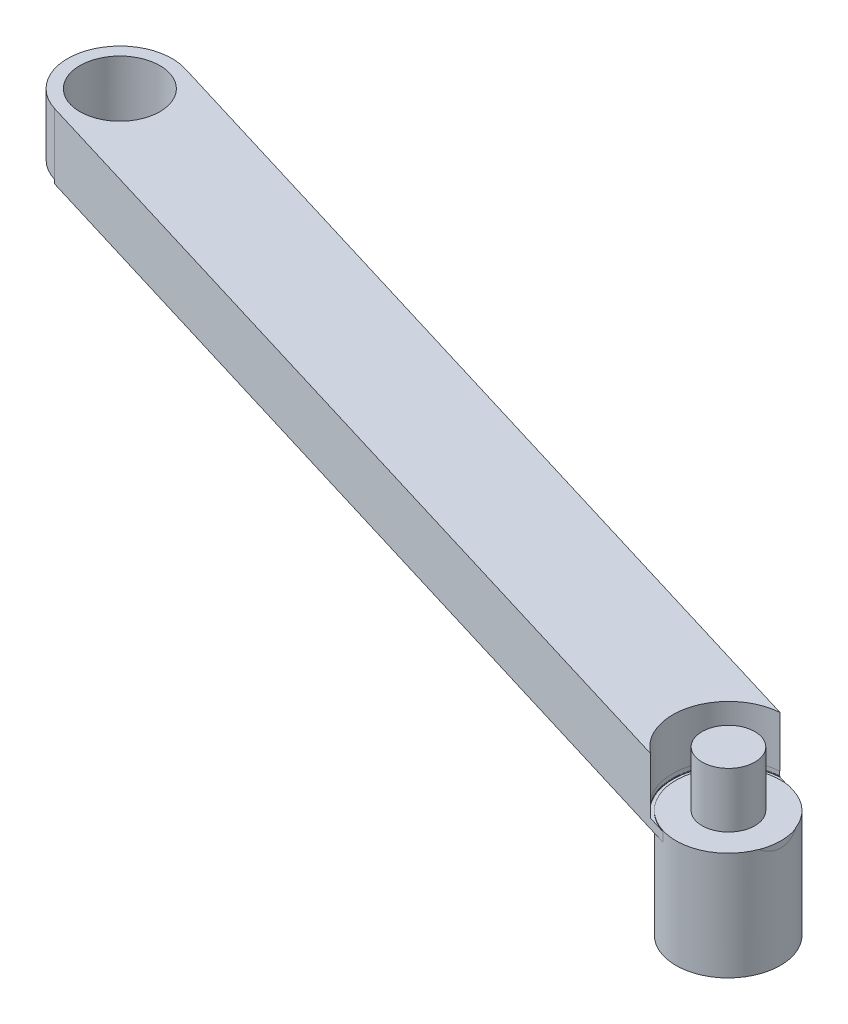
ISO-10303-21;
HEADER;
FILE_DESCRIPTION(('STEP AP214'),'2;1');
FILE_NAME('part.step','',(''),(''),'','','');
FILE_SCHEMA(('AUTOMOTIVE_DESIGN { 1 0 10303 214 1 1 1 1 }'));
ENDSEC;
DATA;
#1=APPLICATION_CONTEXT('core data for automotive mechanical design processes');
#2=APPLICATION_PROTOCOL_DEFINITION('international standard','automotive_design',2000,#1);
#3=PRODUCT_CONTEXT('',#1,'mechanical');
#4=PRODUCT('Part','Part','',(#3));
#5=PRODUCT_RELATED_PRODUCT_CATEGORY('part','',(#4));
#6=PRODUCT_DEFINITION_FORMATION('','',#4);
#7=PRODUCT_DEFINITION_CONTEXT('part definition',#1,'design');
#8=PRODUCT_DEFINITION('design','',#6,#7);
#9=PRODUCT_DEFINITION_SHAPE('','',#8);
#10=(LENGTH_UNIT() NAMED_UNIT(*) SI_UNIT(.MILLI.,.METRE.));
#11=(NAMED_UNIT(*) PLANE_ANGLE_UNIT() SI_UNIT($,.RADIAN.));
#12=(NAMED_UNIT(*) SI_UNIT($,.STERADIAN.) SOLID_ANGLE_UNIT());
#13=UNCERTAINTY_MEASURE_WITH_UNIT(LENGTH_MEASURE(1.E-05),#10,'distance_accuracy_value','');
#14=(GEOMETRIC_REPRESENTATION_CONTEXT(3) GLOBAL_UNCERTAINTY_ASSIGNED_CONTEXT((#13)) GLOBAL_UNIT_ASSIGNED_CONTEXT((#10,
#11,#12)) REPRESENTATION_CONTEXT('',''));
#15=CARTESIAN_POINT('',(0.,0.,0.));
#16=DIRECTION('',(0.,0.,1.));
#17=DIRECTION('',(1.,0.,0.));
#18=AXIS2_PLACEMENT_3D('',#15,#16,#17);
#19=CARTESIAN_POINT('',(-25.9995446629115,44.1741982646806,27.5355118521963));
#20=DIRECTION('',(0.,1.,0.));
#21=DIRECTION('',(0.956704163119757,0.,0.291062096930065));
#22=AXIS2_PLACEMENT_3D('',#19,#20,#21);
#23=PLANE('',#22);
#24=CARTESIAN_POINT('',(64.8873508334654,44.1741982646806,55.1864110605525));
#25=DIRECTION('',(0.,1.,0.));
#26=DIRECTION('',(0.956704163119757,0.,0.291062096930065));
#27=AXIS2_PLACEMENT_3D('',#24,#25,#26);
#28=CIRCLE('',#27,4.);
#29=CARTESIAN_POINT('',(68.7141674859444,44.1741982646806,56.3506594482727));
#30=VERTEX_POINT('',#29);
#31=EDGE_CURVE('E261',#30,#30,#28,.T.);
#32=ORIENTED_EDGE('',*,*,#31,.F.);
#33=EDGE_LOOP('',(#32));
#34=FACE_BOUND('',#33,.T.);
#35=ADVANCED_FACE('F45',(#34),#23,.F.);
#36=CARTESIAN_POINT('',(64.8930357480705,57.4541363944663,55.1677250772969));
#37=DIRECTION('',(0.,-1.,0.));
#38=DIRECTION('',(0.0291383118816099,0.,-0.999575389243198));
#39=AXIS2_PLACEMENT_3D('',#36,#37,#38);
#40=CYLINDRICAL_SURFACE('',#39,4.01953162113846);
#41=CARTESIAN_POINT('',(68.5120653892874,52.7701991631346,56.9167988062531));
#42=CARTESIAN_POINT('',(68.5320828336412,52.7221278434934,56.8753807158891));
#43=CARTESIAN_POINT('',(68.5521676642916,52.6758096040252,56.8320058476421));
#44=CARTESIAN_POINT('',(68.5920181084612,52.5868622370855,56.7414517357876));
#45=CARTESIAN_POINT('',(68.611783581888,52.5442346946901,56.6942708742261));
#46=CARTESIAN_POINT('',(68.6700687594579,52.4218539904196,56.5467950762777));
#47=CARTESIAN_POINT('',(68.7073874409589,52.3480421194024,56.4409443446482));
#48=CARTESIAN_POINT('',(68.7751938496416,52.2184792637633,56.2162023758633));
#49=CARTESIAN_POINT('',(68.8056586191773,52.1627887077172,56.0972692418918));
#50=CARTESIAN_POINT('',(68.8562596580061,52.07237341335,55.84988055207));
#51=CARTESIAN_POINT('',(68.8764244897262,52.0375906483578,55.721452472571));
#52=CARTESIAN_POINT('',(68.9029057457369,51.9928439154912,55.4710216541739));
#53=CARTESIAN_POINT('',(68.9103056600404,51.9809271454764,55.3494816676416));
#54=CARTESIAN_POINT('',(68.9139353757365,51.9764334949345,55.1058361634686));
#55=CARTESIAN_POINT('',(68.9101631973892,51.9838600420934,54.9837305494246));
#56=CARTESIAN_POINT('',(68.8925403772751,52.0163027651151,54.7515397966203));
#57=CARTESIAN_POINT('',(68.8794199277257,52.0400403586657,54.6412145572608));
#58=CARTESIAN_POINT('',(68.8450881149345,52.1025862904002,54.4262596456784));
#59=CARTESIAN_POINT('',(68.823874605951,52.1413986254535,54.3216314923585));
#60=CARTESIAN_POINT('',(68.773562736474,52.2353934426095,54.1140444106715));
#61=CARTESIAN_POINT('',(68.7440645748894,52.2914251653039,54.0115705529702));
#62=CARTESIAN_POINT('',(68.6802234974584,52.4170746399695,53.8170518553445));
#63=CARTESIAN_POINT('',(68.6458821525841,52.4866879892961,53.7250036510636));
#64=CARTESIAN_POINT('',(68.5951968647744,52.5948214358765,53.6017586947762));
#65=CARTESIAN_POINT('',(68.5797511969987,52.6284489267673,53.5657815995579));
#66=CARTESIAN_POINT('',(68.5486962072247,52.6977759093592,53.4961301248221));
#67=CARTESIAN_POINT('',(68.5330873193654,52.7334706862006,53.4624508595444));
#68=CARTESIAN_POINT('',(68.5174841742204,52.7701991631346,53.4299080387363));
#69=B_SPLINE_CURVE_WITH_KNOTS('',3,(#41,#42,#43,#44,#45,#46,#47,#48,#49,#50,#51,#52,#53,#54,#55,
#56,#57,#58,#59,#60,#61,#62,#63,#64,#65,#66,#67,#68),.UNSPECIFIED.,.F.,.F.,(4,2,2,2,2,2,2,2,2,2,
2,2,2,4),(0.,0.19949647436116,0.399078207551685,0.800049133333823,1.20234377852681,
1.60351669281897,1.96856565127002,2.33367930174427,2.67302106211815,3.01245285597977,
3.37244672636312,3.73232409379485,3.88708342006847,4.04150271496431),.UNSPECIFIED.);
#70=CARTESIAN_POINT('',(68.6570358919749,52.4498767005648,56.5780219857596));
#71=VERTEX_POINT('',#70);
#72=CARTESIAN_POINT('',(68.6643823357625,52.4498767005648,53.7771930320583));
#73=VERTEX_POINT('',#72);
#74=EDGE_CURVE('E158',#71,#73,#69,.T.);
#75=ORIENTED_EDGE('',*,*,#74,.T.);
#76=CARTESIAN_POINT('',(64.8930357480705,52.4498767005648,55.1677250772969));
#77=DIRECTION('',(0.,1.,0.));
#78=DIRECTION('',(-0.0291383118816099,0.,0.999575389243198));
#79=AXIS2_PLACEMENT_3D('',#76,#77,#78);
#80=CIRCLE('',#79,4.01953162113846);
#81=EDGE_CURVE('E325',#71,#73,#80,.T.);
#82=ORIENTED_EDGE('',*,*,#81,.F.);
#83=EDGE_LOOP('',(#75,#82));
#84=FACE_BOUND('',#83,.T.);
#85=ADVANCED_FACE('F370',(#84),#40,.T.);
#86=CARTESIAN_POINT('',(116.984664831287,54.2919383485026,56.5862841412071));
#87=DIRECTION('',(-0.999575389243198,0.,-0.0291383118816099));
#88=DIRECTION('',(-0.0291383118816099,0.,0.999575389243198));
#89=AXIS2_PLACEMENT_3D('',#86,#87,#88);
#90=CYLINDRICAL_SURFACE('',#89,2.31365217276674);
#91=CARTESIAN_POINT('',(68.6305208180353,52.4498767005648,53.7762059454664));
#92=CARTESIAN_POINT('',(68.6487620826173,52.4135070230867,53.8246229769609));
#93=CARTESIAN_POINT('',(68.6664943209228,52.3789158246489,53.8745430482517));
#94=CARTESIAN_POINT('',(68.700605440598,52.3134859277549,53.9772691205152));
#95=CARTESIAN_POINT('',(68.7169834595987,52.2826496145984,54.0300769253841));
#96=CARTESIAN_POINT('',(68.7636601095959,52.1959253819904,54.1929456338648));
#97=CARTESIAN_POINT('',(68.7913652057291,52.1460867858058,54.3071017497967));
#98=CARTESIAN_POINT('',(68.8372970872995,52.064594532309,54.5441084924797));
#99=CARTESIAN_POINT('',(68.8554842032362,52.033016927575,54.6669931215435));
#100=CARTESIAN_POINT('',(68.8802462723031,51.9902526228353,54.9171461443951));
#101=CARTESIAN_POINT('',(68.8868523365755,51.979011289208,55.044401854009));
#102=CARTESIAN_POINT('',(68.8877555125507,51.977686918945,55.2882749414438));
#103=CARTESIAN_POINT('',(68.883044951865,51.9858973216265,55.4048832125624));
#104=CARTESIAN_POINT('',(68.8638125198351,52.0197015861573,55.6348210793775));
#105=CARTESIAN_POINT('',(68.8492812408215,52.0453121164282,55.7481474225262));
#106=CARTESIAN_POINT('',(68.8121848808176,52.1120710291255,55.9659245012462));
#107=CARTESIAN_POINT('',(68.789799577773,52.1528728671973,56.0705138315507));
#108=CARTESIAN_POINT('',(68.7388281841445,52.2485447843305,56.2712242746911));
#109=CARTESIAN_POINT('',(68.7102497777448,52.3033974448446,56.3673556758452));
#110=CARTESIAN_POINT('',(68.6660407959979,52.3917389999655,56.499182127393));
#111=CARTESIAN_POINT('',(68.652011120781,52.4202223061095,56.5388476876161));
#112=CARTESIAN_POINT('',(68.6376826716132,52.4498767005648,56.5774578260405));
#113=B_SPLINE_CURVE_WITH_KNOTS('',3,(#91,#92,#93,#94,#95,#96,#97,#98,#99,#100,#101,#102,#103,
#104,#105,#106,#107,#108,#109,#110,#111,#112),.UNSPECIFIED.,.F.,.F.,(4,2,2,2,2,2,2,2,2,2,4),(0.,
0.189639969590812,0.379399786803515,0.760282346211737,1.14273997183633,1.52416858621479,
1.87338726773213,2.22294095523211,2.56496575076364,2.90656857926699,3.05887183267353),.UNSPECIFIED.);
#114=CARTESIAN_POINT('',(68.6305208180353,52.4498767005648,53.7762059454664));
#115=VERTEX_POINT('',#114);
#116=CARTESIAN_POINT('',(68.6376826716132,52.4498767005648,56.5774578260405));
#117=VERTEX_POINT('',#116);
#118=EDGE_CURVE('E156',#115,#117,#113,.T.);
#119=ORIENTED_EDGE('',*,*,#118,.F.);
#120=DIRECTION('',(-0.999575389243198,0.,-0.0291383118816099));
#121=VECTOR('',#120,1.);
#122=CARTESIAN_POINT('',(117.025456337248,52.4498767005648,55.186951687933));
#123=LINE('',#122,#121);
#124=EDGE_CURVE('E164',#73,#115,#123,.T.);
#125=ORIENTED_EDGE('',*,*,#124,.F.);
#126=ORIENTED_EDGE('',*,*,#74,.F.);
#127=DIRECTION('',(-0.999575389243198,0.,-0.0291383118816099));
#128=VECTOR('',#127,1.);
#129=CARTESIAN_POINT('',(116.943873325325,52.4498767005648,57.9856165944812));
#130=LINE('',#129,#128);
#131=EDGE_CURVE('E152',#117,#71,#130,.F.);
#132=ORIENTED_EDGE('',*,*,#131,.F.);
#133=EDGE_LOOP('',(#119,#125,#126,#132));
#134=FACE_BOUND('',#133,.T.);
#135=ADVANCED_FACE('F154',(#134),#90,.T.);
#136=CARTESIAN_POINT('',(-2.08194058491754,56.8890920513354,34.8120642754479));
#137=DIRECTION('',(0.,1.,0.));
#138=DIRECTION('',(-0.0291383118816099,0.,0.999575389243198));
#139=AXIS2_PLACEMENT_3D('',#136,#137,#138);
#140=CYLINDRICAL_SURFACE('',#139,3.06284499681519);
#141=CARTESIAN_POINT('',(-2.08194058491754,56.6741982646806,34.8120642754479));
#142=DIRECTION('',(0.,1.,0.));
#143=DIRECTION('',(-0.999575389243198,0.,-0.0291383118816099));
#144=AXIS2_PLACEMENT_3D('',#141,#142,#143);
#145=CIRCLE('',#144,3.06284499681519);
#146=CARTESIAN_POINT('',(-5.14348506480066,56.6741982646806,34.7228181426857));
#147=VERTEX_POINT('',#146);
#148=EDGE_CURVE('E212',#147,#147,#145,.T.);
#149=ORIENTED_EDGE('',*,*,#148,.T.);
#150=EDGE_LOOP('',(#149));
#151=FACE_BOUND('',#150,.T.);
#152=CARTESIAN_POINT('',(-2.08194058491754,51.9649659412139,34.8120642754479));
#153=DIRECTION('',(0.,1.,0.));
#154=DIRECTION('',(-0.0291383118816099,0.,0.999575389243198));
#155=AXIS2_PLACEMENT_3D('',#152,#153,#154);
#156=CIRCLE('',#155,3.06284499681519);
#157=CARTESIAN_POINT('',(-2.17118671767977,51.9649659412139,37.873608755331));
#158=VERTEX_POINT('',#157);
#159=EDGE_CURVE('E55',#158,#158,#156,.T.);
#160=ORIENTED_EDGE('',*,*,#159,.F.);
#161=EDGE_LOOP('',(#160));
#162=FACE_BOUND('',#161,.T.);
#163=ADVANCED_FACE('F394',(#151,#162),#140,.F.);
#164=CARTESIAN_POINT('',(67.0183938599423,52.383512831824,51.7560557865196));
#165=DIRECTION('',(0.,1.,0.));
#166=DIRECTION('',(-0.0291383118816099,0.,0.999575389243198));
#167=AXIS2_PLACEMENT_3D('',#164,#165,#166);
#168=PLANE('',#167);
#169=DIRECTION('',(0.956704163119757,0.,0.291062096930065));
#170=VECTOR('',#169,1.);
#171=CARTESIAN_POINT('',(-27.1637930506317,52.383512831824,31.3623285046753));
#172=LINE('',#171,#170);
#173=CARTESIAN_POINT('',(62.3548577685909,52.383512831824,58.5969609294239));
#174=VERTEX_POINT('',#173);
#175=CARTESIAN_POINT('',(63.7231024457452,52.383512831824,59.0132277130315));
#176=VERTEX_POINT('',#175);
#177=EDGE_CURVE('E236',#174,#176,#172,.T.);
#178=ORIENTED_EDGE('',*,*,#177,.T.);
#179=CARTESIAN_POINT('',(64.8930357480705,52.383512831824,55.1677250772969));
#180=DIRECTION('',(0.,1.,0.));
#181=DIRECTION('',(-0.0291383118816099,0.,0.999575389243198));
#182=AXIS2_PLACEMENT_3D('',#179,#180,#181);
#183=CIRCLE('',#182,4.01953162113844);
#184=CARTESIAN_POINT('',(65.5167802540928,52.383512831824,51.19688420356));
#185=VERTEX_POINT('',#184);
#186=EDGE_CURVE('E292',#185,#176,#183,.T.);
#187=ORIENTED_EDGE('',*,*,#186,.F.);
#188=DIRECTION('',(0.956704163119757,0.,0.291062096930065));
#189=VECTOR('',#188,1.);
#190=CARTESIAN_POINT('',(-24.8352962751912,52.383512831824,23.7086951997173));
#191=LINE('',#190,#189);
#192=CARTESIAN_POINT('',(64.5825434618207,52.383512831824,50.9126574485502));
#193=VERTEX_POINT('',#192);
#194=EDGE_CURVE('E249',#193,#185,#191,.T.);
#195=ORIENTED_EDGE('',*,*,#194,.F.);
#196=CARTESIAN_POINT('',(64.8930357480705,52.383512831824,55.1677250772969));
#197=DIRECTION('',(0.,1.,0.));
#198=DIRECTION('',(-0.0291383118816099,0.,0.999575389243198));
#199=AXIS2_PLACEMENT_3D('',#196,#197,#198);
#200=CIRCLE('',#199,4.26638090013398);
#201=EDGE_CURVE('E296',#193,#174,#200,.T.);
#202=ORIENTED_EDGE('',*,*,#201,.T.);
#203=EDGE_LOOP('',(#178,#187,#195,#202));
#204=FACE_BOUND('',#203,.T.);
#205=ADVANCED_FACE('F391',(#204),#168,.T.);
#206=CARTESIAN_POINT('',(64.8930357480705,57.4541363944663,55.1677250772969));
#207=DIRECTION('',(0.,1.,0.));
#208=DIRECTION('',(-0.0291383118816099,0.,0.999575389243198));
#209=AXIS2_PLACEMENT_3D('',#206,#207,#208);
#210=CYLINDRICAL_SURFACE('',#209,4.26638090013398);
#211=DIRECTION('',(0.,1.,0.));
#212=VECTOR('',#211,1.);
#213=CARTESIAN_POINT('',(64.5825434618207,57.4541363944663,50.9126574485502));
#214=LINE('',#213,#212);
#215=CARTESIAN_POINT('',(64.5825434618207,52.4498767005648,50.9126574485502));
#216=VERTEX_POINT('',#215);
#217=EDGE_CURVE('E291',#216,#193,#214,.F.);
#218=ORIENTED_EDGE('',*,*,#217,.F.);
#219=CARTESIAN_POINT('',(64.8930357480705,52.4498767005648,55.1677250772969));
#220=DIRECTION('',(0.,1.,0.));
#221=DIRECTION('',(-0.0291383118816099,0.,0.999575389243198));
#222=AXIS2_PLACEMENT_3D('',#219,#220,#221);
#223=CIRCLE('',#222,4.26638090013398);
#224=CARTESIAN_POINT('',(62.3548577685909,52.4498767005648,58.5969609294239));
#225=VERTEX_POINT('',#224);
#226=EDGE_CURVE('E182',#216,#225,#223,.T.);
#227=ORIENTED_EDGE('',*,*,#226,.T.);
#228=DIRECTION('',(0.,1.,0.));
#229=VECTOR('',#228,1.);
#230=CARTESIAN_POINT('',(62.3548577685909,57.4541363944663,58.5969609294239));
#231=LINE('',#230,#229);
#232=EDGE_CURVE('E286',#225,#174,#231,.F.);
#233=ORIENTED_EDGE('',*,*,#232,.T.);
#234=ORIENTED_EDGE('',*,*,#201,.F.);
#235=EDGE_LOOP('',(#218,#227,#233,#234));
#236=FACE_BOUND('',#235,.T.);
#237=ADVANCED_FACE('F319',(#236),#210,.F.);
#238=CARTESIAN_POINT('',(72.9688137710667,52.4498767005648,28.6231129944398));
#239=DIRECTION('',(0.,1.,0.));
#240=DIRECTION('',(-0.0291383118816099,0.,0.999575389243198));
#241=AXIS2_PLACEMENT_3D('',#238,#239,#240);
#242=PLANE('',#241);
#243=DIRECTION('',(0.956704163119757,0.,0.291062096930065));
#244=VECTOR('',#243,1.);
#245=CARTESIAN_POINT('',(-27.1637930506317,52.4498767005648,31.3623285046753));
#246=LINE('',#245,#244);
#247=CARTESIAN_POINT('',(62.3217790604608,52.4498767005648,58.5868972561137));
#248=VERTEX_POINT('',#247);
#249=EDGE_CURVE('E302',#248,#225,#246,.T.);
#250=ORIENTED_EDGE('',*,*,#249,.T.);
#251=ORIENTED_EDGE('',*,*,#226,.F.);
#252=DIRECTION('',(0.956704163119757,0.,0.291062096930065));
#253=VECTOR('',#252,1.);
#254=CARTESIAN_POINT('',(-24.8352962751912,52.4498767005648,23.7086951997173));
#255=LINE('',#254,#253);
#256=CARTESIAN_POINT('',(64.5516863711483,52.4498767005648,50.9032696671832));
#257=VERTEX_POINT('',#256);
#258=EDGE_CURVE('E190',#257,#216,#255,.T.);
#259=ORIENTED_EDGE('',*,*,#258,.F.);
#260=CARTESIAN_POINT('',(64.8930357480705,52.4498767005648,55.1677250772969));
#261=DIRECTION('',(0.,1.,0.));
#262=DIRECTION('',(-0.0291383118816099,0.,0.999575389243198));
#263=AXIS2_PLACEMENT_3D('',#260,#261,#262);
#264=CIRCLE('',#263,4.27809529369937);
#265=EDGE_CURVE('E204',#257,#248,#264,.T.);
#266=ORIENTED_EDGE('',*,*,#265,.T.);
#267=EDGE_LOOP('',(#250,#251,#259,#266));
#268=FACE_BOUND('',#267,.T.);
#269=ADVANCED_FACE('F401',(#268),#242,.T.);
#270=CARTESIAN_POINT('',(64.8930357480705,57.4541363944663,55.1677250772969));
#271=DIRECTION('',(0.,1.,0.));
#272=DIRECTION('',(-0.0291383118816099,0.,0.999575389243198));
#273=AXIS2_PLACEMENT_3D('',#270,#271,#272);
#274=CYLINDRICAL_SURFACE('',#273,4.27809529369937);
#275=DIRECTION('',(0.,1.,0.));
#276=VECTOR('',#275,1.);
#277=CARTESIAN_POINT('',(62.3217790604608,57.4541363944663,58.5868972561137));
#278=LINE('',#277,#276);
#279=CARTESIAN_POINT('',(62.3217790604608,52.7701991631346,58.5868972561137));
#280=VERTEX_POINT('',#279);
#281=EDGE_CURVE('E300',#280,#248,#278,.F.);
#282=ORIENTED_EDGE('',*,*,#281,.T.);
#283=ORIENTED_EDGE('',*,*,#265,.F.);
#284=DIRECTION('',(0.,1.,0.));
#285=VECTOR('',#284,1.);
#286=CARTESIAN_POINT('',(64.5516863711483,57.4541363944663,50.9032696671832));
#287=LINE('',#286,#285);
#288=CARTESIAN_POINT('',(64.5516863711483,52.7701991631346,50.9032696671832));
#289=VERTEX_POINT('',#288);
#290=EDGE_CURVE('E315',#289,#257,#287,.F.);
#291=ORIENTED_EDGE('',*,*,#290,.F.);
#292=CARTESIAN_POINT('',(64.8930357480705,52.7701991631346,55.1677250772969));
#293=DIRECTION('',(0.,1.,0.));
#294=DIRECTION('',(-0.0291383118816099,0.,0.999575389243198));
#295=AXIS2_PLACEMENT_3D('',#292,#293,#294);
#296=CIRCLE('',#295,4.27809529369937);
#297=EDGE_CURVE('E208',#289,#280,#296,.T.);
#298=ORIENTED_EDGE('',*,*,#297,.T.);
#299=EDGE_LOOP('',(#282,#283,#291,#298));
#300=FACE_BOUND('',#299,.T.);
#301=ADVANCED_FACE('F398',(#300),#274,.F.);
#302=CARTESIAN_POINT('',(72.9688137710667,52.7701991631346,28.6231129944398));
#303=DIRECTION('',(0.,1.,0.));
#304=DIRECTION('',(-0.0291383118816099,0.,0.999575389243198));
#305=AXIS2_PLACEMENT_3D('',#302,#303,#304);
#306=PLANE('',#305);
#307=ORIENTED_EDGE('',*,*,#297,.F.);
#308=DIRECTION('',(0.956704163119757,0.,0.291062096930065));
#309=VECTOR('',#308,1.);
#310=CARTESIAN_POINT('',(-24.8352962751912,52.7701991631346,23.7086951997173));
#311=LINE('',#310,#309);
#312=CARTESIAN_POINT('',(64.5825434618207,52.7701991631346,50.9126574485502));
#313=VERTEX_POINT('',#312);
#314=EDGE_CURVE('E200',#289,#313,#311,.T.);
#315=ORIENTED_EDGE('',*,*,#314,.T.);
#316=CARTESIAN_POINT('',(64.8930357480705,52.7701991631346,55.1677250772969));
#317=DIRECTION('',(0.,1.,0.));
#318=DIRECTION('',(-0.0291383118816099,0.,0.999575389243198));
#319=AXIS2_PLACEMENT_3D('',#316,#317,#318);
#320=CIRCLE('',#319,4.26638090013398);
#321=CARTESIAN_POINT('',(62.3548577685909,52.7701991631346,58.5969609294239));
#322=VERTEX_POINT('',#321);
#323=EDGE_CURVE('E201',#313,#322,#320,.T.);
#324=ORIENTED_EDGE('',*,*,#323,.T.);
#325=DIRECTION('',(0.956704163119757,0.,0.291062096930065));
#326=VECTOR('',#325,1.);
#327=CARTESIAN_POINT('',(-27.1637930506317,52.7701991631346,31.3623285046753));
#328=LINE('',#327,#326);
#329=EDGE_CURVE('E196',#280,#322,#328,.T.);
#330=ORIENTED_EDGE('',*,*,#329,.F.);
#331=EDGE_LOOP('',(#307,#315,#324,#330));
#332=FACE_BOUND('',#331,.T.);
#333=ADVANCED_FACE('F47',(#332),#306,.F.);
#334=ORIENTED_EDGE('',*,*,#323,.F.);
#335=CARTESIAN_POINT('',(64.5825434618207,56.6741982646806,50.9126574485502));
#336=VERTEX_POINT('',#335);
#337=EDGE_CURVE('E287',#336,#313,#214,.F.);
#338=ORIENTED_EDGE('',*,*,#337,.F.);
#339=CARTESIAN_POINT('',(64.8930357480705,56.6741982646806,55.1677250772969));
#340=DIRECTION('',(0.,1.,0.));
#341=DIRECTION('',(-0.999575389243198,0.,-0.0291383118816099));
#342=AXIS2_PLACEMENT_3D('',#339,#340,#341);
#343=CIRCLE('',#342,4.26638090013398);
#344=CARTESIAN_POINT('',(62.3548577685909,56.6741982646806,58.5969609294239));
#345=VERTEX_POINT('',#344);
#346=EDGE_CURVE('E253',#345,#336,#343,.F.);
#347=ORIENTED_EDGE('',*,*,#346,.F.);
#348=EDGE_CURVE('E235',#345,#322,#231,.F.);
#349=ORIENTED_EDGE('',*,*,#348,.T.);
#350=EDGE_LOOP('',(#334,#338,#347,#349));
#351=FACE_BOUND('',#350,.T.);
#352=ADVANCED_FACE('F354',(#351),#210,.F.);
#353=CARTESIAN_POINT('',(-25.9995446629115,56.6741982646806,27.5355118521963));
#354=DIRECTION('',(0.,1.,0.));
#355=DIRECTION('',(0.956704163119757,0.,0.291062096930065));
#356=AXIS2_PLACEMENT_3D('',#353,#354,#355);
#357=PLANE('',#356);
#358=ORIENTED_EDGE('',*,*,#148,.F.);
#359=EDGE_LOOP('',(#358));
#360=FACE_BOUND('',#359,.T.);
#361=DIRECTION('',(0.956704163119757,0.,0.291062096930065));
#362=VECTOR('',#361,1.);
#363=CARTESIAN_POINT('',(-27.1637930506317,56.6741982646806,31.3623285046753));
#364=LINE('',#363,#362);
#365=CARTESIAN_POINT('',(-3.24618897263783,56.6741982646806,38.6388809279269));
#366=VERTEX_POINT('',#365);
#367=EDGE_CURVE('E230',#366,#345,#364,.T.);
#368=ORIENTED_EDGE('',*,*,#367,.T.);
#369=ORIENTED_EDGE('',*,*,#346,.T.);
#370=DIRECTION('',(0.956704163119757,0.,0.291062096930065));
#371=VECTOR('',#370,1.);
#372=CARTESIAN_POINT('',(-24.8352962751912,56.6741982646806,23.7086951997173));
#373=LINE('',#372,#371);
#374=CARTESIAN_POINT('',(-0.917692197197305,56.6741982646806,30.9852476229689));
#375=VERTEX_POINT('',#374);
#376=EDGE_CURVE('E226',#375,#336,#373,.T.);
#377=ORIENTED_EDGE('',*,*,#376,.F.);
#378=CARTESIAN_POINT('',(-2.08194058491756,56.6741982646806,34.8120642754479));
#379=DIRECTION('',(0.,1.,0.));
#380=DIRECTION('',(0.956704163119757,0.,0.291062096930065));
#381=AXIS2_PLACEMENT_3D('',#378,#379,#380);
#382=CIRCLE('',#381,4.);
#383=EDGE_CURVE('E231',#375,#366,#382,.T.);
#384=ORIENTED_EDGE('',*,*,#383,.T.);
#385=EDGE_LOOP('',(#368,#369,#377,#384));
#386=FACE_BOUND('',#385,.T.);
#387=ADVANCED_FACE('F343',(#360,#386),#357,.T.);
#388=CARTESIAN_POINT('',(-2.08194058491756,56.6741982646806,34.8120642754479));
#389=DIRECTION('',(0.,-1.,0.));
#390=DIRECTION('',(-0.956704163119757,0.,-0.291062096930065));
#391=AXIS2_PLACEMENT_3D('',#388,#389,#390);
#392=CYLINDRICAL_SURFACE('',#391,4.);
#393=DIRECTION('',(0.,-1.,0.));
#394=VECTOR('',#393,1.);
#395=CARTESIAN_POINT('',(-0.917692197197305,56.6741982646806,30.9852476229689));
#396=LINE('',#395,#394);
#397=CARTESIAN_POINT('',(-0.917692197197305,51.9649659412139,30.9852476229689));
#398=VERTEX_POINT('',#397);
#399=EDGE_CURVE('E268',#375,#398,#396,.T.);
#400=ORIENTED_EDGE('',*,*,#399,.T.);
#401=CARTESIAN_POINT('',(-2.08194058491754,51.9649659412139,34.8120642754479));
#402=DIRECTION('',(0.,1.,0.));
#403=DIRECTION('',(-0.0291383118816099,0.,0.999575389243198));
#404=AXIS2_PLACEMENT_3D('',#401,#402,#403);
#405=CIRCLE('',#404,4.);
#406=CARTESIAN_POINT('',(-3.24618897263783,51.9649659412139,38.6388809279269));
#407=VERTEX_POINT('',#406);
#408=EDGE_CURVE('E219',#398,#407,#405,.T.);
#409=ORIENTED_EDGE('',*,*,#408,.T.);
#410=DIRECTION('',(0.,-1.,0.));
#411=VECTOR('',#410,1.);
#412=CARTESIAN_POINT('',(-3.24618897263783,56.6741982646806,38.6388809279269));
#413=LINE('',#412,#411);
#414=EDGE_CURVE('E334',#366,#407,#413,.T.);
#415=ORIENTED_EDGE('',*,*,#414,.F.);
#416=ORIENTED_EDGE('',*,*,#383,.F.);
#417=EDGE_LOOP('',(#400,#409,#415,#416));
#418=FACE_BOUND('',#417,.T.);
#419=ADVANCED_FACE('F347',(#418),#392,.T.);
#420=CARTESIAN_POINT('',(64.8873508334654,56.6741982646806,55.1864110605525));
#421=DIRECTION('',(0.,-1.,0.));
#422=DIRECTION('',(-0.956704163119757,0.,-0.291062096930065));
#423=AXIS2_PLACEMENT_3D('',#420,#421,#422);
#424=CYLINDRICAL_SURFACE('',#423,4.);
#425=ORIENTED_EDGE('',*,*,#31,.T.);
#426=EDGE_LOOP('',(#425));
#427=FACE_BOUND('',#426,.T.);
#428=CARTESIAN_POINT('',(64.8873508334654,52.4498767005648,55.1864110605525));
#429=DIRECTION('',(0.,1.,0.));
#430=DIRECTION('',(-0.0291383118816099,0.,0.999575389243198));
#431=AXIS2_PLACEMENT_3D('',#428,#429,#430);
#432=CIRCLE('',#431,4.);
#433=CARTESIAN_POINT('',(66.0515992211857,52.4498767005648,51.3595944080734));
#434=VERTEX_POINT('',#433);
#435=EDGE_CURVE('E173',#115,#434,#432,.T.);
#436=ORIENTED_EDGE('',*,*,#435,.F.);
#437=ORIENTED_EDGE('',*,*,#118,.T.);
#438=CARTESIAN_POINT('',(63.7231024457451,52.4498767005648,59.0132277130315));
#439=VERTEX_POINT('',#438);
#440=EDGE_CURVE('E170',#439,#117,#432,.T.);
#441=ORIENTED_EDGE('',*,*,#440,.F.);
#442=DIRECTION('',(0.,-1.,0.));
#443=VECTOR('',#442,1.);
#444=CARTESIAN_POINT('',(63.7231024457451,56.6741982646806,59.0132277130315));
#445=LINE('',#444,#443);
#446=EDGE_CURVE('E241',#439,#176,#445,.T.);
#447=ORIENTED_EDGE('',*,*,#446,.T.);
#448=CARTESIAN_POINT('',(63.7231024457451,51.6741982646806,59.0132277130315));
#449=VERTEX_POINT('',#448);
#450=EDGE_CURVE('E244',#176,#449,#445,.T.);
#451=ORIENTED_EDGE('',*,*,#450,.T.);
#452=CARTESIAN_POINT('',(64.8873508334654,51.6741982646806,55.1864110605525));
#453=DIRECTION('',(0.,1.,0.));
#454=DIRECTION('',(0.956704163119757,0.,0.291062096930065));
#455=AXIS2_PLACEMENT_3D('',#452,#453,#454);
#456=CIRCLE('',#455,4.);
#457=CARTESIAN_POINT('',(66.0515992211857,51.6741982646806,51.3595944080734));
#458=VERTEX_POINT('',#457);
#459=EDGE_CURVE('E271',#458,#449,#456,.T.);
#460=ORIENTED_EDGE('',*,*,#459,.F.);
#461=DIRECTION('',(0.,-1.,0.));
#462=VECTOR('',#461,1.);
#463=CARTESIAN_POINT('',(66.0515992211857,56.6741982646806,51.3595944080734));
#464=LINE('',#463,#462);
#465=EDGE_CURVE('E248',#434,#458,#464,.T.);
#466=ORIENTED_EDGE('',*,*,#465,.F.);
#467=EDGE_LOOP('',(#436,#437,#441,#447,#451,#460,#466));
#468=FACE_BOUND('',#467,.T.);
#469=ADVANCED_FACE('F169',(#427,#468),#424,.T.);
#470=ORIENTED_EDGE('',*,*,#440,.T.);
#471=ORIENTED_EDGE('',*,*,#131,.T.);
#472=ORIENTED_EDGE('',*,*,#81,.T.);
#473=ORIENTED_EDGE('',*,*,#124,.T.);
#474=ORIENTED_EDGE('',*,*,#435,.T.);
#475=CARTESIAN_POINT('',(65.5167802540928,52.4498767005648,51.19688420356));
#476=VERTEX_POINT('',#475);
#477=EDGE_CURVE('E187',#476,#434,#255,.T.);
#478=ORIENTED_EDGE('',*,*,#477,.F.);
#479=CARTESIAN_POINT('',(64.8930357480705,52.4498767005648,55.1677250772969));
#480=DIRECTION('',(0.,1.,0.));
#481=DIRECTION('',(-0.0291383118816099,0.,0.999575389243198));
#482=AXIS2_PLACEMENT_3D('',#479,#480,#481);
#483=CIRCLE('',#482,4.01953162113844);
#484=EDGE_CURVE('E180',#476,#439,#483,.T.);
#485=ORIENTED_EDGE('',*,*,#484,.T.);
#486=EDGE_LOOP('',(#470,#471,#472,#473,#474,#478,#485));
#487=FACE_BOUND('',#486,.T.);
#488=CARTESIAN_POINT('',(64.8930357480705,52.4498767005648,55.1677250772968));
#489=DIRECTION('',(0.,1.,0.));
#490=DIRECTION('',(0.,0.,1.));
#491=AXIS2_PLACEMENT_3D('',#488,#489,#490);
#492=CIRCLE('',#491,2.02221657902994);
#493=CARTESIAN_POINT('',(64.8930357480705,52.4498767005648,57.1899416563268));
#494=VERTEX_POINT('',#493);
#495=EDGE_CURVE('E609',#494,#494,#492,.T.);
#496=ORIENTED_EDGE('',*,*,#495,.F.);
#497=EDGE_LOOP('',(#496));
#498=FACE_BOUND('',#497,.T.);
#499=ADVANCED_FACE('F177',(#487,#498),#242,.T.);
#500=CARTESIAN_POINT('',(64.8930357480705,57.4541363944663,55.1677250772969));
#501=DIRECTION('',(0.,1.,0.));
#502=DIRECTION('',(-0.0291383118816099,0.,0.999575389243198));
#503=AXIS2_PLACEMENT_3D('',#500,#501,#502);
#504=CYLINDRICAL_SURFACE('',#503,4.01953162113844);
#505=ORIENTED_EDGE('',*,*,#484,.F.);
#506=DIRECTION('',(0.,1.,0.));
#507=VECTOR('',#506,1.);
#508=CARTESIAN_POINT('',(65.5167802540928,57.4541363944663,51.19688420356));
#509=LINE('',#508,#507);
#510=EDGE_CURVE('E232',#476,#185,#509,.F.);
#511=ORIENTED_EDGE('',*,*,#510,.T.);
#512=ORIENTED_EDGE('',*,*,#186,.T.);
#513=ORIENTED_EDGE('',*,*,#446,.F.);
#514=EDGE_LOOP('',(#505,#511,#512,#513));
#515=FACE_BOUND('',#514,.T.);
#516=ADVANCED_FACE('F379',(#515),#504,.T.);
#517=CARTESIAN_POINT('',(-27.1637930506317,56.6741982646806,31.3623285046753));
#518=DIRECTION('',(0.291062096930065,0.,-0.956704163119757));
#519=DIRECTION('',(-0.956704163119757,0.,-0.291062096930065));
#520=AXIS2_PLACEMENT_3D('',#517,#518,#519);
#521=PLANE('',#520);
#522=ORIENTED_EDGE('',*,*,#249,.F.);
#523=ORIENTED_EDGE('',*,*,#281,.F.);
#524=ORIENTED_EDGE('',*,*,#329,.T.);
#525=ORIENTED_EDGE('',*,*,#348,.F.);
#526=ORIENTED_EDGE('',*,*,#367,.F.);
#527=ORIENTED_EDGE('',*,*,#414,.T.);
#528=DIRECTION('',(0.,1.,0.));
#529=VECTOR('',#528,1.);
#530=CARTESIAN_POINT('',(-3.24618897263781,56.8890920513354,38.6388809279269));
#531=LINE('',#530,#529);
#532=CARTESIAN_POINT('',(-3.24618897263783,51.6741982646806,38.6388809279269));
#533=VERTEX_POINT('',#532);
#534=EDGE_CURVE('E213',#407,#533,#531,.F.);
#535=ORIENTED_EDGE('',*,*,#534,.T.);
#536=DIRECTION('',(0.956704163119757,0.,0.291062096930065));
#537=VECTOR('',#536,1.);
#538=CARTESIAN_POINT('',(-27.1637930506317,51.6741982646806,31.3623285046753));
#539=LINE('',#538,#537);
#540=EDGE_CURVE('E257',#533,#449,#539,.T.);
#541=ORIENTED_EDGE('',*,*,#540,.T.);
#542=ORIENTED_EDGE('',*,*,#450,.F.);
#543=ORIENTED_EDGE('',*,*,#177,.F.);
#544=ORIENTED_EDGE('',*,*,#232,.F.);
#545=EDGE_LOOP('',(#522,#523,#524,#525,#526,#527,#535,#541,#542,#543,#544));
#546=FACE_BOUND('',#545,.T.);
#547=ADVANCED_FACE('F350',(#546),#521,.F.);
#548=CARTESIAN_POINT('',(-24.8352962751912,56.6741982646806,23.7086951997173));
#549=DIRECTION('',(0.291062096930065,0.,-0.956704163119757));
#550=DIRECTION('',(-0.956704163119757,0.,-0.291062096930065));
#551=AXIS2_PLACEMENT_3D('',#548,#549,#550);
#552=PLANE('',#551);
#553=ORIENTED_EDGE('',*,*,#510,.F.);
#554=ORIENTED_EDGE('',*,*,#477,.T.);
#555=ORIENTED_EDGE('',*,*,#465,.T.);
#556=DIRECTION('',(0.956704163119757,0.,0.291062096930065));
#557=VECTOR('',#556,1.);
#558=CARTESIAN_POINT('',(-24.8352962751912,51.6741982646806,23.7086951997173));
#559=LINE('',#558,#557);
#560=CARTESIAN_POINT('',(-0.917692197197305,51.6741982646806,30.9852476229689));
#561=VERTEX_POINT('',#560);
#562=EDGE_CURVE('E63',#561,#458,#559,.T.);
#563=ORIENTED_EDGE('',*,*,#562,.F.);
#564=DIRECTION('',(0.,1.,0.));
#565=VECTOR('',#564,1.);
#566=CARTESIAN_POINT('',(-0.917692197197284,56.8890920513354,30.9852476229689));
#567=LINE('',#566,#565);
#568=EDGE_CURVE('E216',#398,#561,#567,.F.);
#569=ORIENTED_EDGE('',*,*,#568,.F.);
#570=ORIENTED_EDGE('',*,*,#399,.F.);
#571=ORIENTED_EDGE('',*,*,#376,.T.);
#572=ORIENTED_EDGE('',*,*,#337,.T.);
#573=ORIENTED_EDGE('',*,*,#314,.F.);
#574=ORIENTED_EDGE('',*,*,#290,.T.);
#575=ORIENTED_EDGE('',*,*,#258,.T.);
#576=ORIENTED_EDGE('',*,*,#217,.T.);
#577=ORIENTED_EDGE('',*,*,#194,.T.);
#578=EDGE_LOOP('',(#553,#554,#555,#563,#569,#570,#571,#572,#573,#574,#575,#576,#577));
#579=FACE_BOUND('',#578,.T.);
#580=ADVANCED_FACE('F312',(#579),#552,.T.);
#581=CARTESIAN_POINT('',(5.99952235268369,51.9649659412139,8.24876620933513));
#582=DIRECTION('',(0.,1.,0.));
#583=DIRECTION('',(-0.0291383118816099,0.,0.999575389243198));
#584=AXIS2_PLACEMENT_3D('',#581,#582,#583);
#585=PLANE('',#584);
#586=ORIENTED_EDGE('',*,*,#408,.F.);
#587=EDGE_CURVE('E70',#407,#398,#405,.T.);
#588=ORIENTED_EDGE('',*,*,#587,.F.);
#589=EDGE_LOOP('',(#586,#588));
#590=FACE_BOUND('',#589,.T.);
#591=ORIENTED_EDGE('',*,*,#159,.T.);
#592=EDGE_LOOP('',(#591));
#593=FACE_BOUND('',#592,.T.);
#594=ADVANCED_FACE('F405',(#590,#593),#585,.F.);
#595=CARTESIAN_POINT('',(-2.08194058491754,56.8890920513354,34.8120642754479));
#596=DIRECTION('',(0.,1.,0.));
#597=DIRECTION('',(-0.0291383118816099,0.,0.999575389243198));
#598=AXIS2_PLACEMENT_3D('',#595,#596,#597);
#599=CYLINDRICAL_SURFACE('',#598,4.);
#600=ORIENTED_EDGE('',*,*,#587,.T.);
#601=ORIENTED_EDGE('',*,*,#568,.T.);
#602=CARTESIAN_POINT('',(-2.08194058491754,51.6741982646806,34.8120642754479));
#603=DIRECTION('',(0.,1.,0.));
#604=DIRECTION('',(-0.0291383118816099,0.,0.999575389243198));
#605=AXIS2_PLACEMENT_3D('',#602,#603,#604);
#606=CIRCLE('',#605,4.);
#607=EDGE_CURVE('E11',#533,#561,#606,.T.);
#608=ORIENTED_EDGE('',*,*,#607,.F.);
#609=ORIENTED_EDGE('',*,*,#534,.F.);
#610=EDGE_LOOP('',(#600,#601,#608,#609));
#611=FACE_BOUND('',#610,.T.);
#612=ADVANCED_FACE('F386',(#611),#599,.F.);
#613=CARTESIAN_POINT('',(-25.9995446629115,51.6741982646806,27.5355118521963));
#614=DIRECTION('',(0.,1.,0.));
#615=DIRECTION('',(0.956704163119757,0.,0.291062096930065));
#616=AXIS2_PLACEMENT_3D('',#613,#614,#615);
#617=PLANE('',#616);
#618=ORIENTED_EDGE('',*,*,#607,.T.);
#619=ORIENTED_EDGE('',*,*,#562,.T.);
#620=ORIENTED_EDGE('',*,*,#459,.T.);
#621=ORIENTED_EDGE('',*,*,#540,.F.);
#622=EDGE_LOOP('',(#618,#619,#620,#621));
#623=FACE_BOUND('',#622,.T.);
#624=ADVANCED_FACE('F382',(#623),#617,.F.);
#625=CARTESIAN_POINT('',(64.8930357480705,56.6741982646806,55.1677250772968));
#626=DIRECTION('',(0.,1.,0.));
#627=DIRECTION('',(0.,0.,1.));
#628=AXIS2_PLACEMENT_3D('',#625,#626,#627);
#629=CYLINDRICAL_SURFACE('',#628,2.02221270518966);
#630=ORIENTED_EDGE('',*,*,#495,.T.);
#631=EDGE_LOOP('',(#630));
#632=FACE_BOUND('',#631,.T.);
#633=CARTESIAN_POINT('',(64.8930357480705,56.6741982646806,55.1677250772968));
#634=DIRECTION('',(0.,1.,0.));
#635=DIRECTION('',(0.,0.,1.));
#636=AXIS2_PLACEMENT_3D('',#633,#634,#635);
#637=CIRCLE('',#636,2.02220883134938);
#638=CARTESIAN_POINT('',(64.8930357480705,56.6741982646806,57.1899339086462));
#639=VERTEX_POINT('',#638);
#640=EDGE_CURVE('E175',#639,#639,#637,.T.);
#641=ORIENTED_EDGE('',*,*,#640,.F.);
#642=EDGE_LOOP('',(#641));
#643=FACE_BOUND('',#642,.T.);
#644=ADVANCED_FACE('F385',(#632,#643),#629,.T.);
#645=CARTESIAN_POINT('',(64.8935374486041,56.6741982646806,55.1660760168585));
#646=DIRECTION('',(0.,1.,0.));
#647=DIRECTION('',(-0.998658942772682,0.,0.0517717685630745));
#648=AXIS2_PLACEMENT_3D('',#645,#646,#647);
#649=PLANE('',#648);
#650=ORIENTED_EDGE('',*,*,#640,.T.);
#651=EDGE_LOOP('',(#650));
#652=FACE_BOUND('',#651,.T.);
#653=ADVANCED_FACE('F470',(#652),#649,.T.);
#654=CLOSED_SHELL('',(#35,#85,#135,#163,#205,#237,#269,#301,#333,#352,#387,#419,#469,#499,#516,
#547,#580,#594,#612,#624,#644,#653));
#655=MANIFOLD_SOLID_BREP('B2',#654);
#656=ADVANCED_BREP_SHAPE_REPRESENTATION('',(#18,#655),#14);
#657=SHAPE_DEFINITION_REPRESENTATION(#9,#656);
ENDSEC;
END-ISO-10303-21;
